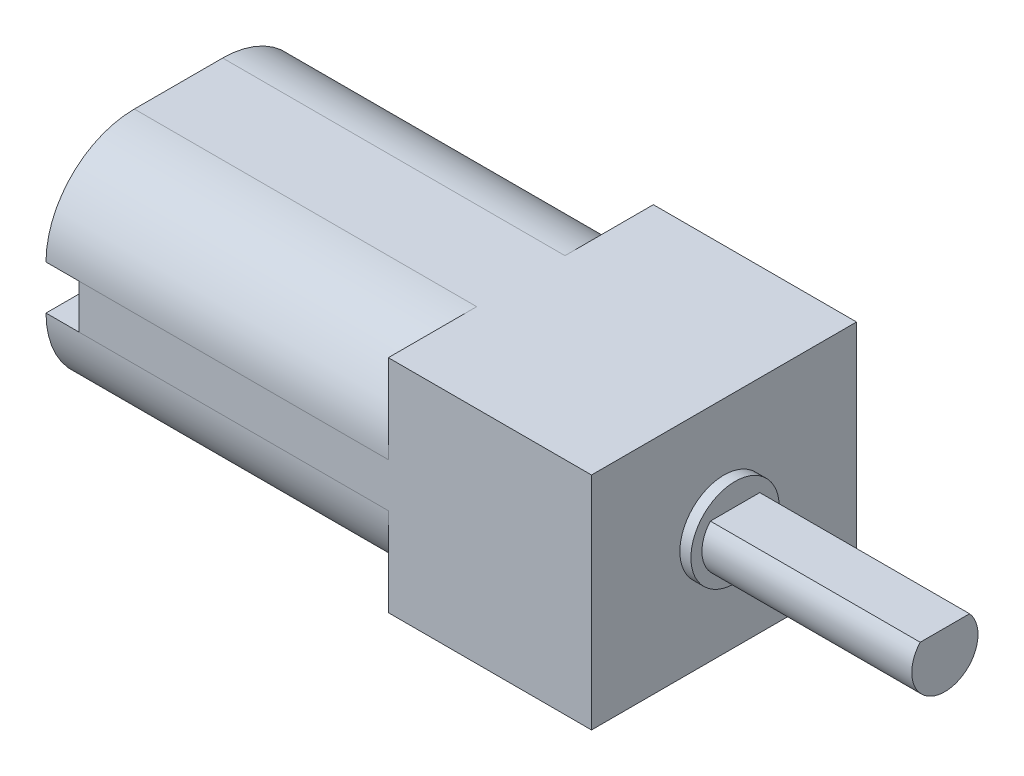
ISO-10303-21;
HEADER;
FILE_DESCRIPTION(('STEP AP214'),'2;1');
FILE_NAME('part.step','',(''),(''),'','','');
FILE_SCHEMA(('AUTOMOTIVE_DESIGN { 1 0 10303 214 1 1 1 1 }'));
ENDSEC;
DATA;
#1=APPLICATION_CONTEXT('core data for automotive mechanical design processes');
#2=APPLICATION_PROTOCOL_DEFINITION('international standard','automotive_design',2000,#1);
#3=PRODUCT_CONTEXT('',#1,'mechanical');
#4=PRODUCT('Part','Part','',(#3));
#5=PRODUCT_RELATED_PRODUCT_CATEGORY('part','',(#4));
#6=PRODUCT_DEFINITION_FORMATION('','',#4);
#7=PRODUCT_DEFINITION_CONTEXT('part definition',#1,'design');
#8=PRODUCT_DEFINITION('design','',#6,#7);
#9=PRODUCT_DEFINITION_SHAPE('','',#8);
#10=(LENGTH_UNIT() NAMED_UNIT(*) SI_UNIT(.MILLI.,.METRE.));
#11=(NAMED_UNIT(*) PLANE_ANGLE_UNIT() SI_UNIT($,.RADIAN.));
#12=(NAMED_UNIT(*) SI_UNIT($,.STERADIAN.) SOLID_ANGLE_UNIT());
#13=UNCERTAINTY_MEASURE_WITH_UNIT(LENGTH_MEASURE(1.E-05),#10,'distance_accuracy_value','');
#14=(GEOMETRIC_REPRESENTATION_CONTEXT(3) GLOBAL_UNCERTAINTY_ASSIGNED_CONTEXT((#13)) GLOBAL_UNIT_ASSIGNED_CONTEXT((#10,
#11,#12)) REPRESENTATION_CONTEXT('',''));
#15=CARTESIAN_POINT('',(0.,0.,0.));
#16=DIRECTION('',(0.,0.,1.));
#17=DIRECTION('',(1.,0.,0.));
#18=AXIS2_PLACEMENT_3D('',#15,#16,#17);
#19=CARTESIAN_POINT('',(-20.1,-1.,-2.));
#20=DIRECTION('',(1.,0.,0.));
#21=DIRECTION('',(0.,0.,-1.));
#22=AXIS2_PLACEMENT_3D('',#19,#20,#21);
#23=PLANE('',#22);
#24=CARTESIAN_POINT('',(-20.1,0.,0.));
#25=DIRECTION('',(1.,0.,0.));
#26=DIRECTION('',(0.,0.,-1.));
#27=AXIS2_PLACEMENT_3D('',#24,#25,#26);
#28=CIRCLE('',#27,2.5);
#29=CARTESIAN_POINT('',(-20.1,0.,-2.5));
#30=VERTEX_POINT('',#29);
#31=EDGE_CURVE('E11',#30,#30,#28,.F.);
#32=ORIENTED_EDGE('',*,*,#31,.F.);
#33=EDGE_LOOP('',(#32));
#34=FACE_BOUND('',#33,.T.);
#35=DIRECTION('',(0.,1.,0.));
#36=VECTOR('',#35,1.);
#37=CARTESIAN_POINT('',(-20.1,-0.59830986798651,-3.3));
#38=LINE('',#37,#36);
#39=CARTESIAN_POINT('',(-20.1,-0.59830986798651,-3.3));
#40=VERTEX_POINT('',#39);
#41=CARTESIAN_POINT('',(-20.1,0.59830986798651,-3.3));
#42=VERTEX_POINT('',#41);
#43=EDGE_CURVE('E239',#40,#42,#38,.T.);
#44=ORIENTED_EDGE('',*,*,#43,.F.);
#45=DIRECTION('',(0.,0.,1.));
#46=VECTOR('',#45,1.);
#47=CARTESIAN_POINT('',(-20.1,-0.59830986798651,-3.7));
#48=LINE('',#47,#46);
#49=CARTESIAN_POINT('',(-20.1,-0.59830986798651,-3.7));
#50=VERTEX_POINT('',#49);
#51=EDGE_CURVE('E252',#50,#40,#48,.T.);
#52=ORIENTED_EDGE('',*,*,#51,.F.);
#53=DIRECTION('',(0.,-1.,0.));
#54=VECTOR('',#53,1.);
#55=CARTESIAN_POINT('',(-20.1,-0.59830986798651,-3.7));
#56=LINE('',#55,#54);
#57=CARTESIAN_POINT('',(-20.1,0.59830986798651,-3.7));
#58=VERTEX_POINT('',#57);
#59=EDGE_CURVE('E261',#58,#50,#56,.T.);
#60=ORIENTED_EDGE('',*,*,#59,.F.);
#61=DIRECTION('',(0.,0.,-1.));
#62=VECTOR('',#61,1.);
#63=CARTESIAN_POINT('',(-20.1,0.59830986798651,-3.7));
#64=LINE('',#63,#62);
#65=EDGE_CURVE('E242',#42,#58,#64,.T.);
#66=ORIENTED_EDGE('',*,*,#65,.F.);
#67=EDGE_LOOP('',(#44,#52,#60,#66));
#68=FACE_BOUND('',#67,.T.);
#69=CARTESIAN_POINT('',(-20.1,1.,-2.));
#70=DIRECTION('',(-1.,0.,0.));
#71=DIRECTION('',(0.,0.,-1.));
#72=AXIS2_PLACEMENT_3D('',#69,#70,#71);
#73=CIRCLE('',#72,4.);
#74=CARTESIAN_POINT('',(-20.1,5.,-1.99999999999997));
#75=VERTEX_POINT('',#74);
#76=CARTESIAN_POINT('',(-20.1,0.999999999999973,-6.));
#77=VERTEX_POINT('',#76);
#78=EDGE_CURVE('E339',#75,#77,#73,.T.);
#79=ORIENTED_EDGE('',*,*,#78,.T.);
#80=DIRECTION('',(0.,0.,-1.));
#81=VECTOR('',#80,1.);
#82=CARTESIAN_POINT('',(-20.1,0.999999999999973,-6.));
#83=LINE('',#82,#81);
#84=CARTESIAN_POINT('',(-20.1,0.999999999999972,-4.5));
#85=VERTEX_POINT('',#84);
#86=EDGE_CURVE('E282',#85,#77,#83,.T.);
#87=ORIENTED_EDGE('',*,*,#86,.F.);
#88=DIRECTION('',(0.,1.,0.));
#89=VECTOR('',#88,1.);
#90=CARTESIAN_POINT('',(-20.1,0.999999999999972,-4.5));
#91=LINE('',#90,#89);
#92=CARTESIAN_POINT('',(-20.1,-0.999999999999971,-4.5));
#93=VERTEX_POINT('',#92);
#94=EDGE_CURVE('E295',#93,#85,#91,.T.);
#95=ORIENTED_EDGE('',*,*,#94,.F.);
#96=DIRECTION('',(0.,0.,1.));
#97=VECTOR('',#96,1.);
#98=CARTESIAN_POINT('',(-20.1,-0.999999999999971,-4.5));
#99=LINE('',#98,#97);
#100=CARTESIAN_POINT('',(-20.1,-0.999999999999971,-6.));
#101=VERTEX_POINT('',#100);
#102=EDGE_CURVE('E292',#101,#93,#99,.T.);
#103=ORIENTED_EDGE('',*,*,#102,.F.);
#104=CARTESIAN_POINT('',(-20.1,-1.,-2.));
#105=DIRECTION('',(-1.,0.,0.));
#106=DIRECTION('',(0.,0.,-1.));
#107=AXIS2_PLACEMENT_3D('',#104,#105,#106);
#108=CIRCLE('',#107,4.);
#109=CARTESIAN_POINT('',(-20.1,-5.,-1.99999999999997));
#110=VERTEX_POINT('',#109);
#111=EDGE_CURVE('E326',#101,#110,#108,.T.);
#112=ORIENTED_EDGE('',*,*,#111,.T.);
#113=DIRECTION('',(0.,0.,1.));
#114=VECTOR('',#113,1.);
#115=CARTESIAN_POINT('',(-20.1,-5.,-1.99999999999997));
#116=LINE('',#115,#114);
#117=CARTESIAN_POINT('',(-20.1,-5.,1.99999999999997));
#118=VERTEX_POINT('',#117);
#119=EDGE_CURVE('E329',#110,#118,#116,.T.);
#120=ORIENTED_EDGE('',*,*,#119,.T.);
#121=CARTESIAN_POINT('',(-20.1,-1.,2.));
#122=DIRECTION('',(-1.,0.,0.));
#123=DIRECTION('',(0.,0.,1.));
#124=AXIS2_PLACEMENT_3D('',#121,#122,#123);
#125=CIRCLE('',#124,4.);
#126=CARTESIAN_POINT('',(-20.1,-0.999999999999971,6.));
#127=VERTEX_POINT('',#126);
#128=EDGE_CURVE('E332',#118,#127,#125,.T.);
#129=ORIENTED_EDGE('',*,*,#128,.T.);
#130=DIRECTION('',(0.,0.,1.));
#131=VECTOR('',#130,1.);
#132=CARTESIAN_POINT('',(-20.1,-0.999999999999971,4.5));
#133=LINE('',#132,#131);
#134=CARTESIAN_POINT('',(-20.1,-0.999999999999971,4.5));
#135=VERTEX_POINT('',#134);
#136=EDGE_CURVE('E308',#135,#127,#133,.T.);
#137=ORIENTED_EDGE('',*,*,#136,.F.);
#138=DIRECTION('',(0.,-1.,0.));
#139=VECTOR('',#138,1.);
#140=CARTESIAN_POINT('',(-20.1,0.999999999999972,4.5));
#141=LINE('',#140,#139);
#142=CARTESIAN_POINT('',(-20.1,0.999999999999972,4.5));
#143=VERTEX_POINT('',#142);
#144=EDGE_CURVE('E320',#143,#135,#141,.T.);
#145=ORIENTED_EDGE('',*,*,#144,.F.);
#146=DIRECTION('',(0.,0.,-1.));
#147=VECTOR('',#146,1.);
#148=CARTESIAN_POINT('',(-20.1,0.999999999999973,6.));
#149=LINE('',#148,#147);
#150=CARTESIAN_POINT('',(-20.1,0.999999999999971,6.));
#151=VERTEX_POINT('',#150);
#152=EDGE_CURVE('E277',#151,#143,#149,.T.);
#153=ORIENTED_EDGE('',*,*,#152,.F.);
#154=CARTESIAN_POINT('',(-20.1,1.,2.));
#155=DIRECTION('',(-1.,0.,0.));
#156=DIRECTION('',(0.,0.,-1.));
#157=AXIS2_PLACEMENT_3D('',#154,#155,#156);
#158=CIRCLE('',#157,4.);
#159=CARTESIAN_POINT('',(-20.1,5.,1.99999999999997));
#160=VERTEX_POINT('',#159);
#161=EDGE_CURVE('E335',#151,#160,#158,.T.);
#162=ORIENTED_EDGE('',*,*,#161,.T.);
#163=DIRECTION('',(0.,0.,-1.));
#164=VECTOR('',#163,1.);
#165=CARTESIAN_POINT('',(-20.1,5.,-1.99999999999997));
#166=LINE('',#165,#164);
#167=EDGE_CURVE('E337',#160,#75,#166,.T.);
#168=ORIENTED_EDGE('',*,*,#167,.T.);
#169=EDGE_LOOP('',(#79,#87,#95,#103,#112,#120,#129,#137,#145,#153,#162,#168));
#170=FACE_BOUND('',#169,.T.);
#171=DIRECTION('',(0.,1.,0.));
#172=VECTOR('',#171,1.);
#173=CARTESIAN_POINT('',(-20.1,-0.59830986798651,3.7));
#174=LINE('',#173,#172);
#175=CARTESIAN_POINT('',(-20.1,-0.59830986798651,3.7));
#176=VERTEX_POINT('',#175);
#177=CARTESIAN_POINT('',(-20.1,0.59830986798651,3.7));
#178=VERTEX_POINT('',#177);
#179=EDGE_CURVE('E238',#176,#178,#174,.T.);
#180=ORIENTED_EDGE('',*,*,#179,.F.);
#181=DIRECTION('',(0.,0.,1.));
#182=VECTOR('',#181,1.);
#183=CARTESIAN_POINT('',(-20.1,-0.59830986798651,3.7));
#184=LINE('',#183,#182);
#185=CARTESIAN_POINT('',(-20.1,-0.59830986798651,3.3));
#186=VERTEX_POINT('',#185);
#187=EDGE_CURVE('E235',#186,#176,#184,.T.);
#188=ORIENTED_EDGE('',*,*,#187,.F.);
#189=DIRECTION('',(0.,-1.,0.));
#190=VECTOR('',#189,1.);
#191=CARTESIAN_POINT('',(-20.1,-0.59830986798651,3.3));
#192=LINE('',#191,#190);
#193=CARTESIAN_POINT('',(-20.1,0.59830986798651,3.3));
#194=VERTEX_POINT('',#193);
#195=EDGE_CURVE('E53',#194,#186,#192,.T.);
#196=ORIENTED_EDGE('',*,*,#195,.F.);
#197=DIRECTION('',(0.,0.,-1.));
#198=VECTOR('',#197,1.);
#199=CARTESIAN_POINT('',(-20.1,0.59830986798651,3.7));
#200=LINE('',#199,#198);
#201=EDGE_CURVE('E48',#178,#194,#200,.T.);
#202=ORIENTED_EDGE('',*,*,#201,.F.);
#203=EDGE_LOOP('',(#180,#188,#196,#202));
#204=FACE_BOUND('',#203,.T.);
#205=ADVANCED_FACE('F33',(#34,#68,#170,#204),#23,.F.);
#206=CARTESIAN_POINT('',(-4.6,5.,6.));
#207=DIRECTION('',(0.,0.,-1.));
#208=DIRECTION('',(-1.,0.,0.));
#209=AXIS2_PLACEMENT_3D('',#206,#207,#208);
#210=PLANE('',#209);
#211=DIRECTION('',(0.,1.,0.));
#212=VECTOR('',#211,1.);
#213=CARTESIAN_POINT('',(-18.6,0.999999999999973,6.));
#214=LINE('',#213,#212);
#215=CARTESIAN_POINT('',(-18.6,-0.999999999999971,6.));
#216=VERTEX_POINT('',#215);
#217=CARTESIAN_POINT('',(-18.6,0.999999999999973,6.));
#218=VERTEX_POINT('',#217);
#219=EDGE_CURVE('E304',#216,#218,#214,.T.);
#220=ORIENTED_EDGE('',*,*,#219,.F.);
#221=DIRECTION('',(1.,0.,0.));
#222=VECTOR('',#221,1.);
#223=CARTESIAN_POINT('',(-20.1,-1.,6.));
#224=LINE('',#223,#222);
#225=CARTESIAN_POINT('',(-4.6,-1.,6.));
#226=VERTEX_POINT('',#225);
#227=EDGE_CURVE('E369',#216,#226,#224,.T.);
#228=ORIENTED_EDGE('',*,*,#227,.T.);
#229=DIRECTION('',(0.,-1.,0.));
#230=VECTOR('',#229,1.);
#231=CARTESIAN_POINT('',(-4.6,5.,6.));
#232=LINE('',#231,#230);
#233=CARTESIAN_POINT('',(-4.6,-5.,6.));
#234=VERTEX_POINT('',#233);
#235=EDGE_CURVE('E425',#226,#234,#232,.T.);
#236=ORIENTED_EDGE('',*,*,#235,.T.);
#237=DIRECTION('',(1.,0.,0.));
#238=VECTOR('',#237,1.);
#239=CARTESIAN_POINT('',(-4.6,-5.,6.));
#240=LINE('',#239,#238);
#241=CARTESIAN_POINT('',(4.6,-5.,6.));
#242=VERTEX_POINT('',#241);
#243=EDGE_CURVE('E405',#234,#242,#240,.T.);
#244=ORIENTED_EDGE('',*,*,#243,.T.);
#245=DIRECTION('',(0.,-1.,0.));
#246=VECTOR('',#245,1.);
#247=CARTESIAN_POINT('',(4.6,5.,6.));
#248=LINE('',#247,#246);
#249=CARTESIAN_POINT('',(4.6,5.,6.));
#250=VERTEX_POINT('',#249);
#251=EDGE_CURVE('E413',#250,#242,#248,.T.);
#252=ORIENTED_EDGE('',*,*,#251,.F.);
#253=DIRECTION('',(1.,0.,0.));
#254=VECTOR('',#253,1.);
#255=CARTESIAN_POINT('',(-4.6,5.,6.));
#256=LINE('',#255,#254);
#257=CARTESIAN_POINT('',(-4.6,5.,6.));
#258=VERTEX_POINT('',#257);
#259=EDGE_CURVE('E411',#258,#250,#256,.T.);
#260=ORIENTED_EDGE('',*,*,#259,.F.);
#261=CARTESIAN_POINT('',(-4.6,1.,6.));
#262=VERTEX_POINT('',#261);
#263=EDGE_CURVE('E426',#258,#262,#232,.T.);
#264=ORIENTED_EDGE('',*,*,#263,.T.);
#265=DIRECTION('',(1.,0.,0.));
#266=VECTOR('',#265,1.);
#267=CARTESIAN_POINT('',(-20.1,0.999999999999971,6.));
#268=LINE('',#267,#266);
#269=EDGE_CURVE('E365',#218,#262,#268,.T.);
#270=ORIENTED_EDGE('',*,*,#269,.F.);
#271=EDGE_LOOP('',(#220,#228,#236,#244,#252,#260,#264,#270));
#272=FACE_BOUND('',#271,.T.);
#273=ADVANCED_FACE('F486',(#272),#210,.F.);
#274=CARTESIAN_POINT('',(-4.6,5.,6.));
#275=DIRECTION('',(1.,0.,0.));
#276=DIRECTION('',(0.,0.,-1.));
#277=AXIS2_PLACEMENT_3D('',#274,#275,#276);
#278=PLANE('',#277);
#279=CARTESIAN_POINT('',(-4.6,-1.,-2.));
#280=DIRECTION('',(-1.,0.,0.));
#281=DIRECTION('',(0.,0.,-1.));
#282=AXIS2_PLACEMENT_3D('',#279,#280,#281);
#283=CIRCLE('',#282,4.);
#284=CARTESIAN_POINT('',(-4.6,-1.,-6.));
#285=VERTEX_POINT('',#284);
#286=CARTESIAN_POINT('',(-4.6,-5.,-2.));
#287=VERTEX_POINT('',#286);
#288=EDGE_CURVE('E302',#285,#287,#283,.T.);
#289=ORIENTED_EDGE('',*,*,#288,.F.);
#290=DIRECTION('',(0.,-1.,0.));
#291=VECTOR('',#290,1.);
#292=CARTESIAN_POINT('',(-4.6,5.,-6.));
#293=LINE('',#292,#291);
#294=CARTESIAN_POINT('',(-4.6,-5.,-6.));
#295=VERTEX_POINT('',#294);
#296=EDGE_CURVE('E429',#285,#295,#293,.T.);
#297=ORIENTED_EDGE('',*,*,#296,.T.);
#298=DIRECTION('',(0.,0.,1.));
#299=VECTOR('',#298,1.);
#300=CARTESIAN_POINT('',(-4.6,-5.,6.));
#301=LINE('',#300,#299);
#302=EDGE_CURVE('E420',#295,#287,#301,.T.);
#303=ORIENTED_EDGE('',*,*,#302,.T.);
#304=EDGE_LOOP('',(#289,#297,#303));
#305=FACE_BOUND('',#304,.T.);
#306=ADVANCED_FACE('F451',(#305),#278,.F.);
#307=CARTESIAN_POINT('',(-4.6,1.,-2.));
#308=DIRECTION('',(-1.,0.,0.));
#309=DIRECTION('',(0.,0.,-1.));
#310=AXIS2_PLACEMENT_3D('',#307,#308,#309);
#311=CIRCLE('',#310,4.);
#312=CARTESIAN_POINT('',(-4.6,5.,-2.));
#313=VERTEX_POINT('',#312);
#314=CARTESIAN_POINT('',(-4.6,1.,-6.));
#315=VERTEX_POINT('',#314);
#316=EDGE_CURVE('E330',#313,#315,#311,.T.);
#317=ORIENTED_EDGE('',*,*,#316,.F.);
#318=DIRECTION('',(0.,0.,1.));
#319=VECTOR('',#318,1.);
#320=CARTESIAN_POINT('',(-4.6,5.,6.));
#321=LINE('',#320,#319);
#322=CARTESIAN_POINT('',(-4.6,5.,-6.));
#323=VERTEX_POINT('',#322);
#324=EDGE_CURVE('E408',#323,#313,#321,.T.);
#325=ORIENTED_EDGE('',*,*,#324,.F.);
#326=EDGE_CURVE('E430',#323,#315,#293,.T.);
#327=ORIENTED_EDGE('',*,*,#326,.T.);
#328=EDGE_LOOP('',(#317,#325,#327));
#329=FACE_BOUND('',#328,.T.);
#330=ADVANCED_FACE('F477',(#329),#278,.F.);
#331=CARTESIAN_POINT('',(-4.6,1.,2.));
#332=DIRECTION('',(-1.,0.,0.));
#333=DIRECTION('',(0.,0.,-1.));
#334=AXIS2_PLACEMENT_3D('',#331,#332,#333);
#335=CIRCLE('',#334,4.);
#336=CARTESIAN_POINT('',(-4.6,5.,2.));
#337=VERTEX_POINT('',#336);
#338=EDGE_CURVE('E348',#262,#337,#335,.T.);
#339=ORIENTED_EDGE('',*,*,#338,.F.);
#340=ORIENTED_EDGE('',*,*,#263,.F.);
#341=EDGE_CURVE('E407',#337,#258,#321,.T.);
#342=ORIENTED_EDGE('',*,*,#341,.F.);
#343=EDGE_LOOP('',(#339,#340,#342));
#344=FACE_BOUND('',#343,.T.);
#345=ADVANCED_FACE('F515',(#344),#278,.F.);
#346=CARTESIAN_POINT('',(4.6,5.,6.));
#347=DIRECTION('',(-1.,0.,0.));
#348=DIRECTION('',(0.,0.,1.));
#349=AXIS2_PLACEMENT_3D('',#346,#347,#348);
#350=PLANE('',#349);
#351=CARTESIAN_POINT('',(4.6,0.,0.));
#352=DIRECTION('',(1.,0.,0.));
#353=DIRECTION('',(0.,0.,-1.));
#354=AXIS2_PLACEMENT_3D('',#351,#352,#353);
#355=CIRCLE('',#354,2.);
#356=CARTESIAN_POINT('',(4.6,0.,-2.));
#357=VERTEX_POINT('',#356);
#358=EDGE_CURVE('E394',#357,#357,#355,.T.);
#359=ORIENTED_EDGE('',*,*,#358,.F.);
#360=EDGE_LOOP('',(#359));
#361=FACE_BOUND('',#360,.T.);
#362=DIRECTION('',(0.,0.,-1.));
#363=VECTOR('',#362,1.);
#364=CARTESIAN_POINT('',(4.6,-5.,6.));
#365=LINE('',#364,#363);
#366=CARTESIAN_POINT('',(4.6,-5.,-6.));
#367=VERTEX_POINT('',#366);
#368=EDGE_CURVE('E397',#242,#367,#365,.T.);
#369=ORIENTED_EDGE('',*,*,#368,.T.);
#370=DIRECTION('',(0.,-1.,0.));
#371=VECTOR('',#370,1.);
#372=CARTESIAN_POINT('',(4.6,5.,-6.));
#373=LINE('',#372,#371);
#374=CARTESIAN_POINT('',(4.6,5.,-6.));
#375=VERTEX_POINT('',#374);
#376=EDGE_CURVE('E400',#375,#367,#373,.T.);
#377=ORIENTED_EDGE('',*,*,#376,.F.);
#378=DIRECTION('',(0.,0.,-1.));
#379=VECTOR('',#378,1.);
#380=CARTESIAN_POINT('',(4.6,5.,6.));
#381=LINE('',#380,#379);
#382=EDGE_CURVE('E401',#250,#375,#381,.T.);
#383=ORIENTED_EDGE('',*,*,#382,.F.);
#384=ORIENTED_EDGE('',*,*,#251,.T.);
#385=EDGE_LOOP('',(#369,#377,#383,#384));
#386=FACE_BOUND('',#385,.T.);
#387=ADVANCED_FACE('F35',(#361,#386),#350,.F.);
#388=CARTESIAN_POINT('',(-4.6,5.,-6.));
#389=DIRECTION('',(0.,0.,1.));
#390=DIRECTION('',(1.,0.,0.));
#391=AXIS2_PLACEMENT_3D('',#388,#389,#390);
#392=PLANE('',#391);
#393=DIRECTION('',(1.,0.,0.));
#394=VECTOR('',#393,1.);
#395=CARTESIAN_POINT('',(-20.1,-0.999999999999971,-6.));
#396=LINE('',#395,#394);
#397=CARTESIAN_POINT('',(-18.6,-0.999999999999971,-6.));
#398=VERTEX_POINT('',#397);
#399=EDGE_CURVE('E342',#398,#285,#396,.T.);
#400=ORIENTED_EDGE('',*,*,#399,.F.);
#401=DIRECTION('',(0.,-1.,0.));
#402=VECTOR('',#401,1.);
#403=CARTESIAN_POINT('',(-18.6,0.999999999999973,-6.));
#404=LINE('',#403,#402);
#405=CARTESIAN_POINT('',(-18.6,0.999999999999973,-6.));
#406=VERTEX_POINT('',#405);
#407=EDGE_CURVE('E278',#406,#398,#404,.T.);
#408=ORIENTED_EDGE('',*,*,#407,.F.);
#409=DIRECTION('',(1.,0.,0.));
#410=VECTOR('',#409,1.);
#411=CARTESIAN_POINT('',(-20.1,0.999999999999972,-6.));
#412=LINE('',#411,#410);
#413=EDGE_CURVE('E356',#406,#315,#412,.T.);
#414=ORIENTED_EDGE('',*,*,#413,.T.);
#415=ORIENTED_EDGE('',*,*,#326,.F.);
#416=DIRECTION('',(-1.,0.,0.));
#417=VECTOR('',#416,1.);
#418=CARTESIAN_POINT('',(-4.6,5.,-6.));
#419=LINE('',#418,#417);
#420=EDGE_CURVE('E404',#375,#323,#419,.T.);
#421=ORIENTED_EDGE('',*,*,#420,.F.);
#422=ORIENTED_EDGE('',*,*,#376,.T.);
#423=DIRECTION('',(-1.,0.,0.));
#424=VECTOR('',#423,1.);
#425=CARTESIAN_POINT('',(-4.6,-5.,-6.));
#426=LINE('',#425,#424);
#427=EDGE_CURVE('E416',#367,#295,#426,.T.);
#428=ORIENTED_EDGE('',*,*,#427,.T.);
#429=ORIENTED_EDGE('',*,*,#296,.F.);
#430=EDGE_LOOP('',(#400,#408,#414,#415,#421,#422,#428,#429));
#431=FACE_BOUND('',#430,.T.);
#432=ADVANCED_FACE('F436',(#431),#392,.F.);
#433=CARTESIAN_POINT('',(-4.6,-1.,2.));
#434=DIRECTION('',(-1.,0.,0.));
#435=DIRECTION('',(0.,0.,1.));
#436=AXIS2_PLACEMENT_3D('',#433,#434,#435);
#437=CIRCLE('',#436,4.);
#438=CARTESIAN_POINT('',(-4.6,-5.,2.));
#439=VERTEX_POINT('',#438);
#440=EDGE_CURVE('E345',#439,#226,#437,.T.);
#441=ORIENTED_EDGE('',*,*,#440,.F.);
#442=EDGE_CURVE('E419',#439,#234,#301,.T.);
#443=ORIENTED_EDGE('',*,*,#442,.T.);
#444=ORIENTED_EDGE('',*,*,#235,.F.);
#445=EDGE_LOOP('',(#441,#443,#444));
#446=FACE_BOUND('',#445,.T.);
#447=ADVANCED_FACE('F491',(#446),#278,.F.);
#448=CARTESIAN_POINT('',(0.,5.,0.));
#449=DIRECTION('',(0.,-1.,0.));
#450=DIRECTION('',(0.,0.,-1.));
#451=AXIS2_PLACEMENT_3D('',#448,#449,#450);
#452=PLANE('',#451);
#453=ORIENTED_EDGE('',*,*,#382,.T.);
#454=ORIENTED_EDGE('',*,*,#420,.T.);
#455=ORIENTED_EDGE('',*,*,#324,.T.);
#456=DIRECTION('',(1.,0.,0.));
#457=VECTOR('',#456,1.);
#458=CARTESIAN_POINT('',(-20.1,5.,-1.99999999999997));
#459=LINE('',#458,#457);
#460=EDGE_CURVE('E359',#75,#313,#459,.T.);
#461=ORIENTED_EDGE('',*,*,#460,.F.);
#462=ORIENTED_EDGE('',*,*,#167,.F.);
#463=DIRECTION('',(1.,0.,0.));
#464=VECTOR('',#463,1.);
#465=CARTESIAN_POINT('',(-20.1,5.,1.99999999999997));
#466=LINE('',#465,#464);
#467=EDGE_CURVE('E362',#160,#337,#466,.T.);
#468=ORIENTED_EDGE('',*,*,#467,.T.);
#469=ORIENTED_EDGE('',*,*,#341,.T.);
#470=ORIENTED_EDGE('',*,*,#259,.T.);
#471=EDGE_LOOP('',(#453,#454,#455,#461,#462,#468,#469,#470));
#472=FACE_BOUND('',#471,.T.);
#473=ADVANCED_FACE('F480',(#472),#452,.F.);
#474=CARTESIAN_POINT('',(0.,-5.,0.));
#475=DIRECTION('',(0.,-1.,0.));
#476=DIRECTION('',(0.,0.,-1.));
#477=AXIS2_PLACEMENT_3D('',#474,#475,#476);
#478=PLANE('',#477);
#479=ORIENTED_EDGE('',*,*,#368,.F.);
#480=ORIENTED_EDGE('',*,*,#243,.F.);
#481=ORIENTED_EDGE('',*,*,#442,.F.);
#482=DIRECTION('',(1.,0.,0.));
#483=VECTOR('',#482,1.);
#484=CARTESIAN_POINT('',(-20.1,-5.,1.99999999999997));
#485=LINE('',#484,#483);
#486=EDGE_CURVE('E372',#118,#439,#485,.T.);
#487=ORIENTED_EDGE('',*,*,#486,.F.);
#488=ORIENTED_EDGE('',*,*,#119,.F.);
#489=DIRECTION('',(1.,0.,0.));
#490=VECTOR('',#489,1.);
#491=CARTESIAN_POINT('',(-20.1,-5.,-1.99999999999997));
#492=LINE('',#491,#490);
#493=EDGE_CURVE('E375',#110,#287,#492,.T.);
#494=ORIENTED_EDGE('',*,*,#493,.T.);
#495=ORIENTED_EDGE('',*,*,#302,.F.);
#496=ORIENTED_EDGE('',*,*,#427,.F.);
#497=EDGE_LOOP('',(#479,#480,#481,#487,#488,#494,#495,#496));
#498=FACE_BOUND('',#497,.T.);
#499=ADVANCED_FACE('F446',(#498),#478,.T.);
#500=CARTESIAN_POINT('',(5.1,0.,0.));
#501=DIRECTION('',(-1.,0.,0.));
#502=DIRECTION('',(0.,0.,1.));
#503=AXIS2_PLACEMENT_3D('',#500,#501,#502);
#504=CYLINDRICAL_SURFACE('',#503,2.);
#505=CARTESIAN_POINT('',(5.1,0.,0.));
#506=DIRECTION('',(1.,0.,0.));
#507=DIRECTION('',(0.,0.,-1.));
#508=AXIS2_PLACEMENT_3D('',#505,#506,#507);
#509=CIRCLE('',#508,2.);
#510=CARTESIAN_POINT('',(5.1,0.,-2.));
#511=VERTEX_POINT('',#510);
#512=EDGE_CURVE('E391',#511,#511,#509,.T.);
#513=ORIENTED_EDGE('',*,*,#512,.F.);
#514=EDGE_LOOP('',(#513));
#515=FACE_BOUND('',#514,.T.);
#516=ORIENTED_EDGE('',*,*,#358,.T.);
#517=EDGE_LOOP('',(#516));
#518=FACE_BOUND('',#517,.T.);
#519=ADVANCED_FACE('F562',(#515,#518),#504,.T.);
#520=CARTESIAN_POINT('',(5.1,0.,0.));
#521=DIRECTION('',(1.,0.,0.));
#522=DIRECTION('',(0.,0.,-1.));
#523=AXIS2_PLACEMENT_3D('',#520,#521,#522);
#524=PLANE('',#523);
#525=CARTESIAN_POINT('',(5.1,0.,0.));
#526=DIRECTION('',(1.,0.,0.));
#527=DIRECTION('',(0.,0.,-1.));
#528=AXIS2_PLACEMENT_3D('',#525,#526,#527);
#529=CIRCLE('',#528,1.5);
#530=CARTESIAN_POINT('',(5.1,1.,1.11803398874989));
#531=VERTEX_POINT('',#530);
#532=CARTESIAN_POINT('',(5.1,1.,-1.11803398874989));
#533=VERTEX_POINT('',#532);
#534=EDGE_CURVE('E41',#531,#533,#529,.T.);
#535=ORIENTED_EDGE('',*,*,#534,.F.);
#536=DIRECTION('',(0.,0.,-1.));
#537=VECTOR('',#536,1.);
#538=CARTESIAN_POINT('',(5.1,1.,1.11803398874989));
#539=LINE('',#538,#537);
#540=EDGE_CURVE('E379',#531,#533,#539,.T.);
#541=ORIENTED_EDGE('',*,*,#540,.T.);
#542=EDGE_LOOP('',(#535,#541));
#543=FACE_BOUND('',#542,.T.);
#544=ORIENTED_EDGE('',*,*,#512,.T.);
#545=EDGE_LOOP('',(#544));
#546=FACE_BOUND('',#545,.T.);
#547=ADVANCED_FACE('F558',(#543,#546),#524,.T.);
#548=CARTESIAN_POINT('',(14.6,0.,0.));
#549=DIRECTION('',(-1.,0.,0.));
#550=DIRECTION('',(0.,0.,1.));
#551=AXIS2_PLACEMENT_3D('',#548,#549,#550);
#552=CYLINDRICAL_SURFACE('',#551,1.5);
#553=CARTESIAN_POINT('',(14.6,0.,0.));
#554=DIRECTION('',(1.,0.,0.));
#555=DIRECTION('',(0.,0.,-1.));
#556=AXIS2_PLACEMENT_3D('',#553,#554,#555);
#557=CIRCLE('',#556,1.5);
#558=CARTESIAN_POINT('',(14.6,1.,1.1180339887499));
#559=VERTEX_POINT('',#558);
#560=CARTESIAN_POINT('',(14.6,1.,-1.11803398874989));
#561=VERTEX_POINT('',#560);
#562=EDGE_CURVE('E387',#559,#561,#557,.T.);
#563=ORIENTED_EDGE('',*,*,#562,.F.);
#564=DIRECTION('',(1.,0.,0.));
#565=VECTOR('',#564,1.);
#566=CARTESIAN_POINT('',(5.1,1.,1.11803398874989));
#567=LINE('',#566,#565);
#568=EDGE_CURVE('E382',#531,#559,#567,.T.);
#569=ORIENTED_EDGE('',*,*,#568,.F.);
#570=ORIENTED_EDGE('',*,*,#534,.T.);
#571=DIRECTION('',(1.,0.,0.));
#572=VECTOR('',#571,1.);
#573=CARTESIAN_POINT('',(5.1,1.,-1.11803398874989));
#574=LINE('',#573,#572);
#575=EDGE_CURVE('E384',#533,#561,#574,.T.);
#576=ORIENTED_EDGE('',*,*,#575,.T.);
#577=EDGE_LOOP('',(#563,#569,#570,#576));
#578=FACE_BOUND('',#577,.T.);
#579=ADVANCED_FACE('F554',(#578),#552,.T.);
#580=CARTESIAN_POINT('',(14.6,0.,0.));
#581=DIRECTION('',(1.,0.,0.));
#582=DIRECTION('',(0.,0.,-1.));
#583=AXIS2_PLACEMENT_3D('',#580,#581,#582);
#584=PLANE('',#583);
#585=DIRECTION('',(0.,0.,-1.));
#586=VECTOR('',#585,1.);
#587=CARTESIAN_POINT('',(14.6,1.,1.11803398874989));
#588=LINE('',#587,#586);
#589=EDGE_CURVE('E378',#559,#561,#588,.T.);
#590=ORIENTED_EDGE('',*,*,#589,.F.);
#591=ORIENTED_EDGE('',*,*,#562,.T.);
#592=EDGE_LOOP('',(#590,#591));
#593=FACE_BOUND('',#592,.T.);
#594=ADVANCED_FACE('F550',(#593),#584,.T.);
#595=CARTESIAN_POINT('',(5.1,1.,1.11803398874989));
#596=DIRECTION('',(0.,-1.,0.));
#597=DIRECTION('',(0.,0.,-1.));
#598=AXIS2_PLACEMENT_3D('',#595,#596,#597);
#599=PLANE('',#598);
#600=ORIENTED_EDGE('',*,*,#589,.T.);
#601=ORIENTED_EDGE('',*,*,#575,.F.);
#602=ORIENTED_EDGE('',*,*,#540,.F.);
#603=ORIENTED_EDGE('',*,*,#568,.T.);
#604=EDGE_LOOP('',(#600,#601,#602,#603));
#605=FACE_BOUND('',#604,.T.);
#606=ADVANCED_FACE('F547',(#605),#599,.F.);
#607=CARTESIAN_POINT('',(-20.1,-1.,-2.));
#608=DIRECTION('',(1.,0.,0.));
#609=DIRECTION('',(0.,0.,-1.));
#610=AXIS2_PLACEMENT_3D('',#607,#608,#609);
#611=CYLINDRICAL_SURFACE('',#610,4.);
#612=ORIENTED_EDGE('',*,*,#288,.T.);
#613=ORIENTED_EDGE('',*,*,#493,.F.);
#614=ORIENTED_EDGE('',*,*,#111,.F.);
#615=EDGE_CURVE('E353',#101,#398,#396,.T.);
#616=ORIENTED_EDGE('',*,*,#615,.T.);
#617=ORIENTED_EDGE('',*,*,#399,.T.);
#618=EDGE_LOOP('',(#612,#613,#614,#616,#617));
#619=FACE_BOUND('',#618,.T.);
#620=ADVANCED_FACE('F456',(#619),#611,.T.);
#621=CARTESIAN_POINT('',(-20.1,-1.,2.));
#622=DIRECTION('',(1.,0.,0.));
#623=DIRECTION('',(0.,0.,-1.));
#624=AXIS2_PLACEMENT_3D('',#621,#622,#623);
#625=CYLINDRICAL_SURFACE('',#624,4.);
#626=ORIENTED_EDGE('',*,*,#440,.T.);
#627=ORIENTED_EDGE('',*,*,#227,.F.);
#628=EDGE_CURVE('E370',#127,#216,#224,.T.);
#629=ORIENTED_EDGE('',*,*,#628,.F.);
#630=ORIENTED_EDGE('',*,*,#128,.F.);
#631=ORIENTED_EDGE('',*,*,#486,.T.);
#632=EDGE_LOOP('',(#626,#627,#629,#630,#631));
#633=FACE_BOUND('',#632,.T.);
#634=ADVANCED_FACE('F495',(#633),#625,.T.);
#635=CARTESIAN_POINT('',(-20.1,1.,2.));
#636=DIRECTION('',(1.,0.,0.));
#637=DIRECTION('',(0.,0.,-1.));
#638=AXIS2_PLACEMENT_3D('',#635,#636,#637);
#639=CYLINDRICAL_SURFACE('',#638,4.);
#640=ORIENTED_EDGE('',*,*,#338,.T.);
#641=ORIENTED_EDGE('',*,*,#467,.F.);
#642=ORIENTED_EDGE('',*,*,#161,.F.);
#643=EDGE_CURVE('E366',#151,#218,#268,.T.);
#644=ORIENTED_EDGE('',*,*,#643,.T.);
#645=ORIENTED_EDGE('',*,*,#269,.T.);
#646=EDGE_LOOP('',(#640,#641,#642,#644,#645));
#647=FACE_BOUND('',#646,.T.);
#648=ADVANCED_FACE('F511',(#647),#639,.T.);
#649=CARTESIAN_POINT('',(-20.1,1.,-2.));
#650=DIRECTION('',(1.,0.,0.));
#651=DIRECTION('',(0.,0.,-1.));
#652=AXIS2_PLACEMENT_3D('',#649,#650,#651);
#653=CYLINDRICAL_SURFACE('',#652,4.);
#654=ORIENTED_EDGE('',*,*,#316,.T.);
#655=ORIENTED_EDGE('',*,*,#413,.F.);
#656=EDGE_CURVE('E357',#77,#406,#412,.T.);
#657=ORIENTED_EDGE('',*,*,#656,.F.);
#658=ORIENTED_EDGE('',*,*,#78,.F.);
#659=ORIENTED_EDGE('',*,*,#460,.T.);
#660=EDGE_LOOP('',(#654,#655,#657,#658,#659));
#661=FACE_BOUND('',#660,.T.);
#662=ADVANCED_FACE('F474',(#661),#653,.T.);
#663=CARTESIAN_POINT('',(-18.6,-0.999999999999971,4.5));
#664=DIRECTION('',(0.,-1.,0.));
#665=DIRECTION('',(0.,0.,-1.));
#666=AXIS2_PLACEMENT_3D('',#663,#664,#665);
#667=PLANE('',#666);
#668=ORIENTED_EDGE('',*,*,#136,.T.);
#669=ORIENTED_EDGE('',*,*,#628,.T.);
#670=DIRECTION('',(0.,0.,1.));
#671=VECTOR('',#670,1.);
#672=CARTESIAN_POINT('',(-18.6,-0.999999999999971,4.5));
#673=LINE('',#672,#671);
#674=CARTESIAN_POINT('',(-18.6,-0.999999999999971,4.5));
#675=VERTEX_POINT('',#674);
#676=EDGE_CURVE('E314',#675,#216,#673,.T.);
#677=ORIENTED_EDGE('',*,*,#676,.F.);
#678=DIRECTION('',(-1.,0.,0.));
#679=VECTOR('',#678,1.);
#680=CARTESIAN_POINT('',(-18.6,-0.999999999999971,4.5));
#681=LINE('',#680,#679);
#682=EDGE_CURVE('E296',#675,#135,#681,.T.);
#683=ORIENTED_EDGE('',*,*,#682,.T.);
#684=EDGE_LOOP('',(#668,#669,#677,#683));
#685=FACE_BOUND('',#684,.T.);
#686=ADVANCED_FACE('F501',(#685),#667,.F.);
#687=CARTESIAN_POINT('',(-18.6,0.999999999999972,4.5));
#688=DIRECTION('',(0.,0.,-1.));
#689=DIRECTION('',(-1.,0.,0.));
#690=AXIS2_PLACEMENT_3D('',#687,#688,#689);
#691=PLANE('',#690);
#692=ORIENTED_EDGE('',*,*,#144,.T.);
#693=ORIENTED_EDGE('',*,*,#682,.F.);
#694=DIRECTION('',(0.,-1.,0.));
#695=VECTOR('',#694,1.);
#696=CARTESIAN_POINT('',(-18.6,0.999999999999972,4.5));
#697=LINE('',#696,#695);
#698=CARTESIAN_POINT('',(-18.6,0.999999999999972,4.5));
#699=VERTEX_POINT('',#698);
#700=EDGE_CURVE('E311',#699,#675,#697,.T.);
#701=ORIENTED_EDGE('',*,*,#700,.F.);
#702=DIRECTION('',(-1.,0.,0.));
#703=VECTOR('',#702,1.);
#704=CARTESIAN_POINT('',(-18.6,0.999999999999972,4.5));
#705=LINE('',#704,#703);
#706=EDGE_CURVE('E317',#699,#143,#705,.T.);
#707=ORIENTED_EDGE('',*,*,#706,.T.);
#708=EDGE_LOOP('',(#692,#693,#701,#707));
#709=FACE_BOUND('',#708,.T.);
#710=ADVANCED_FACE('F505',(#709),#691,.F.);
#711=CARTESIAN_POINT('',(-18.6,0.999999999999973,6.));
#712=DIRECTION('',(0.,1.,0.));
#713=DIRECTION('',(0.,0.,1.));
#714=AXIS2_PLACEMENT_3D('',#711,#712,#713);
#715=PLANE('',#714);
#716=ORIENTED_EDGE('',*,*,#152,.T.);
#717=ORIENTED_EDGE('',*,*,#706,.F.);
#718=DIRECTION('',(0.,0.,-1.));
#719=VECTOR('',#718,1.);
#720=CARTESIAN_POINT('',(-18.6,0.999999999999973,6.));
#721=LINE('',#720,#719);
#722=EDGE_CURVE('E307',#218,#699,#721,.T.);
#723=ORIENTED_EDGE('',*,*,#722,.F.);
#724=ORIENTED_EDGE('',*,*,#643,.F.);
#725=EDGE_LOOP('',(#716,#717,#723,#724));
#726=FACE_BOUND('',#725,.T.);
#727=ADVANCED_FACE('F507',(#726),#715,.F.);
#728=CARTESIAN_POINT('',(-18.6,0.,0.));
#729=DIRECTION('',(-1.,0.,0.));
#730=DIRECTION('',(0.,0.,1.));
#731=AXIS2_PLACEMENT_3D('',#728,#729,#730);
#732=PLANE('',#731);
#733=ORIENTED_EDGE('',*,*,#219,.T.);
#734=ORIENTED_EDGE('',*,*,#722,.T.);
#735=ORIENTED_EDGE('',*,*,#700,.T.);
#736=ORIENTED_EDGE('',*,*,#676,.T.);
#737=EDGE_LOOP('',(#733,#734,#735,#736));
#738=FACE_BOUND('',#737,.T.);
#739=ADVANCED_FACE('F517',(#738),#732,.T.);
#740=CARTESIAN_POINT('',(-18.6,0.999999999999973,-6.));
#741=DIRECTION('',(0.,1.,0.));
#742=DIRECTION('',(0.,0.,1.));
#743=AXIS2_PLACEMENT_3D('',#740,#741,#742);
#744=PLANE('',#743);
#745=ORIENTED_EDGE('',*,*,#86,.T.);
#746=ORIENTED_EDGE('',*,*,#656,.T.);
#747=DIRECTION('',(0.,0.,-1.));
#748=VECTOR('',#747,1.);
#749=CARTESIAN_POINT('',(-18.6,0.999999999999973,-6.));
#750=LINE('',#749,#748);
#751=CARTESIAN_POINT('',(-18.6,0.999999999999972,-4.5));
#752=VERTEX_POINT('',#751);
#753=EDGE_CURVE('E288',#752,#406,#750,.T.);
#754=ORIENTED_EDGE('',*,*,#753,.F.);
#755=DIRECTION('',(-1.,0.,0.));
#756=VECTOR('',#755,1.);
#757=CARTESIAN_POINT('',(-18.6,0.999999999999972,-4.5));
#758=LINE('',#757,#756);
#759=EDGE_CURVE('E300',#752,#85,#758,.T.);
#760=ORIENTED_EDGE('',*,*,#759,.T.);
#761=EDGE_LOOP('',(#745,#746,#754,#760));
#762=FACE_BOUND('',#761,.T.);
#763=ADVANCED_FACE('F470',(#762),#744,.F.);
#764=CARTESIAN_POINT('',(-18.6,0.999999999999972,-4.5));
#765=DIRECTION('',(0.,0.,1.));
#766=DIRECTION('',(1.,0.,0.));
#767=AXIS2_PLACEMENT_3D('',#764,#765,#766);
#768=PLANE('',#767);
#769=ORIENTED_EDGE('',*,*,#94,.T.);
#770=ORIENTED_EDGE('',*,*,#759,.F.);
#771=DIRECTION('',(0.,1.,0.));
#772=VECTOR('',#771,1.);
#773=CARTESIAN_POINT('',(-18.6,0.999999999999972,-4.5));
#774=LINE('',#773,#772);
#775=CARTESIAN_POINT('',(-18.6,-0.999999999999971,-4.5));
#776=VERTEX_POINT('',#775);
#777=EDGE_CURVE('E285',#776,#752,#774,.T.);
#778=ORIENTED_EDGE('',*,*,#777,.F.);
#779=DIRECTION('',(-1.,0.,0.));
#780=VECTOR('',#779,1.);
#781=CARTESIAN_POINT('',(-18.6,-0.999999999999971,-4.5));
#782=LINE('',#781,#780);
#783=EDGE_CURVE('E291',#776,#93,#782,.T.);
#784=ORIENTED_EDGE('',*,*,#783,.T.);
#785=EDGE_LOOP('',(#769,#770,#778,#784));
#786=FACE_BOUND('',#785,.T.);
#787=ADVANCED_FACE('F464',(#786),#768,.F.);
#788=CARTESIAN_POINT('',(-18.6,-0.999999999999971,-4.5));
#789=DIRECTION('',(0.,-1.,0.));
#790=DIRECTION('',(0.,0.,-1.));
#791=AXIS2_PLACEMENT_3D('',#788,#789,#790);
#792=PLANE('',#791);
#793=ORIENTED_EDGE('',*,*,#102,.T.);
#794=ORIENTED_EDGE('',*,*,#783,.F.);
#795=DIRECTION('',(0.,0.,1.));
#796=VECTOR('',#795,1.);
#797=CARTESIAN_POINT('',(-18.6,-0.999999999999971,-4.5));
#798=LINE('',#797,#796);
#799=EDGE_CURVE('E281',#398,#776,#798,.T.);
#800=ORIENTED_EDGE('',*,*,#799,.F.);
#801=ORIENTED_EDGE('',*,*,#615,.F.);
#802=EDGE_LOOP('',(#793,#794,#800,#801));
#803=FACE_BOUND('',#802,.T.);
#804=ADVANCED_FACE('F459',(#803),#792,.F.);
#805=CARTESIAN_POINT('',(-18.6,0.,0.));
#806=DIRECTION('',(1.,0.,0.));
#807=DIRECTION('',(0.,0.,-1.));
#808=AXIS2_PLACEMENT_3D('',#805,#806,#807);
#809=PLANE('',#808);
#810=ORIENTED_EDGE('',*,*,#407,.T.);
#811=ORIENTED_EDGE('',*,*,#799,.T.);
#812=ORIENTED_EDGE('',*,*,#777,.T.);
#813=ORIENTED_EDGE('',*,*,#753,.T.);
#814=EDGE_LOOP('',(#810,#811,#812,#813));
#815=FACE_BOUND('',#814,.T.);
#816=ADVANCED_FACE('F468',(#815),#809,.F.);
#817=CARTESIAN_POINT('',(-21.8,-0.59830986798651,-3.3));
#818=DIRECTION('',(0.,0.,-1.));
#819=DIRECTION('',(-1.,0.,0.));
#820=AXIS2_PLACEMENT_3D('',#817,#818,#819);
#821=PLANE('',#820);
#822=ORIENTED_EDGE('',*,*,#43,.T.);
#823=DIRECTION('',(1.,0.,0.));
#824=VECTOR('',#823,1.);
#825=CARTESIAN_POINT('',(-21.8,0.59830986798651,-3.3));
#826=LINE('',#825,#824);
#827=CARTESIAN_POINT('',(-21.8,0.59830986798651,-3.3));
#828=VERTEX_POINT('',#827);
#829=EDGE_CURVE('E274',#828,#42,#826,.T.);
#830=ORIENTED_EDGE('',*,*,#829,.F.);
#831=DIRECTION('',(0.,1.,0.));
#832=VECTOR('',#831,1.);
#833=CARTESIAN_POINT('',(-21.8,-0.59830986798651,-3.3));
#834=LINE('',#833,#832);
#835=CARTESIAN_POINT('',(-21.8,-0.59830986798651,-3.3));
#836=VERTEX_POINT('',#835);
#837=EDGE_CURVE('E248',#836,#828,#834,.T.);
#838=ORIENTED_EDGE('',*,*,#837,.F.);
#839=DIRECTION('',(1.,0.,0.));
#840=VECTOR('',#839,1.);
#841=CARTESIAN_POINT('',(-21.8,-0.59830986798651,-3.3));
#842=LINE('',#841,#840);
#843=EDGE_CURVE('E257',#836,#40,#842,.T.);
#844=ORIENTED_EDGE('',*,*,#843,.T.);
#845=EDGE_LOOP('',(#822,#830,#838,#844));
#846=FACE_BOUND('',#845,.T.);
#847=ADVANCED_FACE('F684',(#846),#821,.F.);
#848=CARTESIAN_POINT('',(-21.8,0.59830986798651,-3.7));
#849=DIRECTION('',(0.,-1.,0.));
#850=DIRECTION('',(0.,0.,-1.));
#851=AXIS2_PLACEMENT_3D('',#848,#849,#850);
#852=PLANE('',#851);
#853=ORIENTED_EDGE('',*,*,#65,.T.);
#854=DIRECTION('',(1.,0.,0.));
#855=VECTOR('',#854,1.);
#856=CARTESIAN_POINT('',(-21.8,0.59830986798651,-3.7));
#857=LINE('',#856,#855);
#858=CARTESIAN_POINT('',(-21.8,0.59830986798651,-3.7));
#859=VERTEX_POINT('',#858);
#860=EDGE_CURVE('E271',#859,#58,#857,.T.);
#861=ORIENTED_EDGE('',*,*,#860,.F.);
#862=DIRECTION('',(0.,0.,-1.));
#863=VECTOR('',#862,1.);
#864=CARTESIAN_POINT('',(-21.8,0.59830986798651,-3.7));
#865=LINE('',#864,#863);
#866=EDGE_CURVE('E251',#828,#859,#865,.T.);
#867=ORIENTED_EDGE('',*,*,#866,.F.);
#868=ORIENTED_EDGE('',*,*,#829,.T.);
#869=EDGE_LOOP('',(#853,#861,#867,#868));
#870=FACE_BOUND('',#869,.T.);
#871=ADVANCED_FACE('F694',(#870),#852,.F.);
#872=CARTESIAN_POINT('',(-21.8,-0.59830986798651,-3.7));
#873=DIRECTION('',(0.,0.,1.));
#874=DIRECTION('',(1.,0.,0.));
#875=AXIS2_PLACEMENT_3D('',#872,#873,#874);
#876=PLANE('',#875);
#877=ORIENTED_EDGE('',*,*,#59,.T.);
#878=DIRECTION('',(1.,0.,0.));
#879=VECTOR('',#878,1.);
#880=CARTESIAN_POINT('',(-21.8,-0.59830986798651,-3.7));
#881=LINE('',#880,#879);
#882=CARTESIAN_POINT('',(-21.8,-0.59830986798651,-3.7));
#883=VERTEX_POINT('',#882);
#884=EDGE_CURVE('E268',#883,#50,#881,.T.);
#885=ORIENTED_EDGE('',*,*,#884,.F.);
#886=DIRECTION('',(0.,-1.,0.));
#887=VECTOR('',#886,1.);
#888=CARTESIAN_POINT('',(-21.8,-0.59830986798651,-3.7));
#889=LINE('',#888,#887);
#890=EDGE_CURVE('E254',#859,#883,#889,.T.);
#891=ORIENTED_EDGE('',*,*,#890,.F.);
#892=ORIENTED_EDGE('',*,*,#860,.T.);
#893=EDGE_LOOP('',(#877,#885,#891,#892));
#894=FACE_BOUND('',#893,.T.);
#895=ADVANCED_FACE('F704',(#894),#876,.F.);
#896=CARTESIAN_POINT('',(-21.8,-0.59830986798651,-3.7));
#897=DIRECTION('',(0.,1.,0.));
#898=DIRECTION('',(0.,0.,1.));
#899=AXIS2_PLACEMENT_3D('',#896,#897,#898);
#900=PLANE('',#899);
#901=ORIENTED_EDGE('',*,*,#51,.T.);
#902=ORIENTED_EDGE('',*,*,#843,.F.);
#903=DIRECTION('',(0.,0.,1.));
#904=VECTOR('',#903,1.);
#905=CARTESIAN_POINT('',(-21.8,-0.59830986798651,-3.7));
#906=LINE('',#905,#904);
#907=EDGE_CURVE('E256',#883,#836,#906,.T.);
#908=ORIENTED_EDGE('',*,*,#907,.F.);
#909=ORIENTED_EDGE('',*,*,#884,.T.);
#910=EDGE_LOOP('',(#901,#902,#908,#909));
#911=FACE_BOUND('',#910,.T.);
#912=ADVANCED_FACE('F714',(#911),#900,.F.);
#913=CARTESIAN_POINT('',(-21.8,0.,0.));
#914=DIRECTION('',(1.,0.,0.));
#915=DIRECTION('',(0.,0.,-1.));
#916=AXIS2_PLACEMENT_3D('',#913,#914,#915);
#917=PLANE('',#916);
#918=ORIENTED_EDGE('',*,*,#837,.T.);
#919=ORIENTED_EDGE('',*,*,#866,.T.);
#920=ORIENTED_EDGE('',*,*,#890,.T.);
#921=ORIENTED_EDGE('',*,*,#907,.T.);
#922=EDGE_LOOP('',(#918,#919,#920,#921));
#923=FACE_BOUND('',#922,.T.);
#924=ADVANCED_FACE('F724',(#923),#917,.F.);
#925=CARTESIAN_POINT('',(-21.8,-0.59830986798651,3.7));
#926=DIRECTION('',(0.,0.,-1.));
#927=DIRECTION('',(-1.,0.,0.));
#928=AXIS2_PLACEMENT_3D('',#925,#926,#927);
#929=PLANE('',#928);
#930=ORIENTED_EDGE('',*,*,#179,.T.);
#931=DIRECTION('',(1.,0.,0.));
#932=VECTOR('',#931,1.);
#933=CARTESIAN_POINT('',(-21.8,0.59830986798651,3.7));
#934=LINE('',#933,#932);
#935=CARTESIAN_POINT('',(-21.8,0.59830986798651,3.7));
#936=VERTEX_POINT('',#935);
#937=EDGE_CURVE('E219',#936,#178,#934,.T.);
#938=ORIENTED_EDGE('',*,*,#937,.F.);
#939=DIRECTION('',(0.,1.,0.));
#940=VECTOR('',#939,1.);
#941=CARTESIAN_POINT('',(-21.8,-0.59830986798651,3.7));
#942=LINE('',#941,#940);
#943=CARTESIAN_POINT('',(-21.8,-0.59830986798651,3.7));
#944=VERTEX_POINT('',#943);
#945=EDGE_CURVE('E226',#944,#936,#942,.T.);
#946=ORIENTED_EDGE('',*,*,#945,.F.);
#947=DIRECTION('',(1.,0.,0.));
#948=VECTOR('',#947,1.);
#949=CARTESIAN_POINT('',(-21.8,-0.59830986798651,3.7));
#950=LINE('',#949,#948);
#951=EDGE_CURVE('E838',#944,#176,#950,.T.);
#952=ORIENTED_EDGE('',*,*,#951,.T.);
#953=EDGE_LOOP('',(#930,#938,#946,#952));
#954=FACE_BOUND('',#953,.T.);
#955=ADVANCED_FACE('F237',(#954),#929,.F.);
#956=CARTESIAN_POINT('',(-21.8,0.59830986798651,3.7));
#957=DIRECTION('',(0.,-1.,0.));
#958=DIRECTION('',(0.,0.,-1.));
#959=AXIS2_PLACEMENT_3D('',#956,#957,#958);
#960=PLANE('',#959);
#961=ORIENTED_EDGE('',*,*,#201,.T.);
#962=DIRECTION('',(1.,0.,0.));
#963=VECTOR('',#962,1.);
#964=CARTESIAN_POINT('',(-21.8,0.59830986798651,3.3));
#965=LINE('',#964,#963);
#966=CARTESIAN_POINT('',(-21.8,0.59830986798651,3.3));
#967=VERTEX_POINT('',#966);
#968=EDGE_CURVE('E222',#967,#194,#965,.T.);
#969=ORIENTED_EDGE('',*,*,#968,.F.);
#970=DIRECTION('',(0.,0.,-1.));
#971=VECTOR('',#970,1.);
#972=CARTESIAN_POINT('',(-21.8,0.59830986798651,3.7));
#973=LINE('',#972,#971);
#974=EDGE_CURVE('E215',#936,#967,#973,.T.);
#975=ORIENTED_EDGE('',*,*,#974,.F.);
#976=ORIENTED_EDGE('',*,*,#937,.T.);
#977=EDGE_LOOP('',(#961,#969,#975,#976));
#978=FACE_BOUND('',#977,.T.);
#979=ADVANCED_FACE('F217',(#978),#960,.F.);
#980=CARTESIAN_POINT('',(-21.8,-0.59830986798651,3.3));
#981=DIRECTION('',(0.,0.,1.));
#982=DIRECTION('',(1.,0.,0.));
#983=AXIS2_PLACEMENT_3D('',#980,#981,#982);
#984=PLANE('',#983);
#985=ORIENTED_EDGE('',*,*,#195,.T.);
#986=DIRECTION('',(1.,0.,0.));
#987=VECTOR('',#986,1.);
#988=CARTESIAN_POINT('',(-21.8,-0.59830986798651,3.3));
#989=LINE('',#988,#987);
#990=CARTESIAN_POINT('',(-21.8,-0.59830986798651,3.3));
#991=VERTEX_POINT('',#990);
#992=EDGE_CURVE('E244',#991,#186,#989,.T.);
#993=ORIENTED_EDGE('',*,*,#992,.F.);
#994=DIRECTION('',(0.,-1.,0.));
#995=VECTOR('',#994,1.);
#996=CARTESIAN_POINT('',(-21.8,-0.59830986798651,3.3));
#997=LINE('',#996,#995);
#998=EDGE_CURVE('E225',#967,#991,#997,.T.);
#999=ORIENTED_EDGE('',*,*,#998,.F.);
#1000=ORIENTED_EDGE('',*,*,#968,.T.);
#1001=EDGE_LOOP('',(#985,#993,#999,#1000));
#1002=FACE_BOUND('',#1001,.T.);
#1003=ADVANCED_FACE('F751',(#1002),#984,.F.);
#1004=CARTESIAN_POINT('',(-21.8,-0.59830986798651,3.7));
#1005=DIRECTION('',(0.,1.,0.));
#1006=DIRECTION('',(0.,0.,1.));
#1007=AXIS2_PLACEMENT_3D('',#1004,#1005,#1006);
#1008=PLANE('',#1007);
#1009=ORIENTED_EDGE('',*,*,#187,.T.);
#1010=ORIENTED_EDGE('',*,*,#951,.F.);
#1011=DIRECTION('',(0.,0.,1.));
#1012=VECTOR('',#1011,1.);
#1013=CARTESIAN_POINT('',(-21.8,-0.59830986798651,3.7));
#1014=LINE('',#1013,#1012);
#1015=EDGE_CURVE('E231',#991,#944,#1014,.T.);
#1016=ORIENTED_EDGE('',*,*,#1015,.F.);
#1017=ORIENTED_EDGE('',*,*,#992,.T.);
#1018=EDGE_LOOP('',(#1009,#1010,#1016,#1017));
#1019=FACE_BOUND('',#1018,.T.);
#1020=ADVANCED_FACE('F760',(#1019),#1008,.F.);
#1021=CARTESIAN_POINT('',(-21.8,0.,0.));
#1022=DIRECTION('',(-1.,0.,0.));
#1023=DIRECTION('',(0.,0.,1.));
#1024=AXIS2_PLACEMENT_3D('',#1021,#1022,#1023);
#1025=PLANE('',#1024);
#1026=ORIENTED_EDGE('',*,*,#945,.T.);
#1027=ORIENTED_EDGE('',*,*,#974,.T.);
#1028=ORIENTED_EDGE('',*,*,#998,.T.);
#1029=ORIENTED_EDGE('',*,*,#1015,.T.);
#1030=EDGE_LOOP('',(#1026,#1027,#1028,#1029));
#1031=FACE_BOUND('',#1030,.T.);
#1032=ADVANCED_FACE('F229',(#1031),#1025,.T.);
#1033=CARTESIAN_POINT('',(-21.6,0.,0.));
#1034=DIRECTION('',(1.,0.,0.));
#1035=DIRECTION('',(0.,0.,-1.));
#1036=AXIS2_PLACEMENT_3D('',#1033,#1034,#1035);
#1037=CYLINDRICAL_SURFACE('',#1036,2.5);
#1038=CARTESIAN_POINT('',(-21.6,0.,0.));
#1039=DIRECTION('',(-1.,0.,0.));
#1040=DIRECTION('',(0.,0.,1.));
#1041=AXIS2_PLACEMENT_3D('',#1038,#1039,#1040);
#1042=CIRCLE('',#1041,2.5);
#1043=CARTESIAN_POINT('',(-21.6,0.,2.5));
#1044=VERTEX_POINT('',#1043);
#1045=EDGE_CURVE('E828',#1044,#1044,#1042,.T.);
#1046=ORIENTED_EDGE('',*,*,#1045,.F.);
#1047=EDGE_LOOP('',(#1046));
#1048=FACE_BOUND('',#1047,.T.);
#1049=ORIENTED_EDGE('',*,*,#31,.T.);
#1050=EDGE_LOOP('',(#1049));
#1051=FACE_BOUND('',#1050,.T.);
#1052=ADVANCED_FACE('F778',(#1048,#1051),#1037,.T.);
#1053=CARTESIAN_POINT('',(-21.6,0.,0.));
#1054=DIRECTION('',(-1.,0.,0.));
#1055=DIRECTION('',(0.,0.,1.));
#1056=AXIS2_PLACEMENT_3D('',#1053,#1054,#1055);
#1057=PLANE('',#1056);
#1058=CARTESIAN_POINT('',(-21.6,0.,0.));
#1059=DIRECTION('',(-1.,0.,0.));
#1060=DIRECTION('',(0.,0.,1.));
#1061=AXIS2_PLACEMENT_3D('',#1058,#1059,#1060);
#1062=CIRCLE('',#1061,1.67595279878546);
#1063=CARTESIAN_POINT('',(-21.6,0.,1.67595279878546));
#1064=VERTEX_POINT('',#1063);
#1065=EDGE_CURVE('E829',#1064,#1064,#1062,.T.);
#1066=ORIENTED_EDGE('',*,*,#1065,.F.);
#1067=EDGE_LOOP('',(#1066));
#1068=FACE_BOUND('',#1067,.T.);
#1069=ORIENTED_EDGE('',*,*,#1045,.T.);
#1070=EDGE_LOOP('',(#1069));
#1071=FACE_BOUND('',#1070,.T.);
#1072=ADVANCED_FACE('F791',(#1068,#1071),#1057,.T.);
#1073=CARTESIAN_POINT('',(-21.1,0.,0.));
#1074=DIRECTION('',(-1.,0.,0.));
#1075=DIRECTION('',(0.,0.,1.));
#1076=AXIS2_PLACEMENT_3D('',#1073,#1074,#1075);
#1077=CYLINDRICAL_SURFACE('',#1076,1.67595279878546);
#1078=CARTESIAN_POINT('',(-21.1,0.,0.));
#1079=DIRECTION('',(-1.,0.,0.));
#1080=DIRECTION('',(0.,0.,1.));
#1081=AXIS2_PLACEMENT_3D('',#1078,#1079,#1080);
#1082=CIRCLE('',#1081,1.67595279878546);
#1083=CARTESIAN_POINT('',(-21.1,0.,1.67595279878546));
#1084=VERTEX_POINT('',#1083);
#1085=EDGE_CURVE('E827',#1084,#1084,#1082,.T.);
#1086=ORIENTED_EDGE('',*,*,#1085,.F.);
#1087=EDGE_LOOP('',(#1086));
#1088=FACE_BOUND('',#1087,.T.);
#1089=ORIENTED_EDGE('',*,*,#1065,.T.);
#1090=EDGE_LOOP('',(#1089));
#1091=FACE_BOUND('',#1090,.T.);
#1092=ADVANCED_FACE('F801',(#1088,#1091),#1077,.F.);
#1093=CARTESIAN_POINT('',(-21.1,0.,0.));
#1094=DIRECTION('',(-1.,0.,0.));
#1095=DIRECTION('',(0.,0.,1.));
#1096=AXIS2_PLACEMENT_3D('',#1093,#1094,#1095);
#1097=PLANE('',#1096);
#1098=ORIENTED_EDGE('',*,*,#1085,.T.);
#1099=EDGE_LOOP('',(#1098));
#1100=FACE_BOUND('',#1099,.T.);
#1101=ADVANCED_FACE('F811',(#1100),#1097,.T.);
#1102=CLOSED_SHELL('',(#205,#273,#306,#330,#345,#387,#432,#447,#473,#499,#519,#547,#579,#594,
#606,#620,#634,#648,#662,#686,#710,#727,#739,#763,#787,#804,#816,#847,#871,#895,#912,#924,#955,
#979,#1003,#1020,#1032,#1052,#1072,#1092,#1101));
#1103=MANIFOLD_SOLID_BREP('B2',#1102);
#1104=ADVANCED_BREP_SHAPE_REPRESENTATION('',(#18,#1103),#14);
#1105=SHAPE_DEFINITION_REPRESENTATION(#9,#1104);
ENDSEC;
END-ISO-10303-21;
